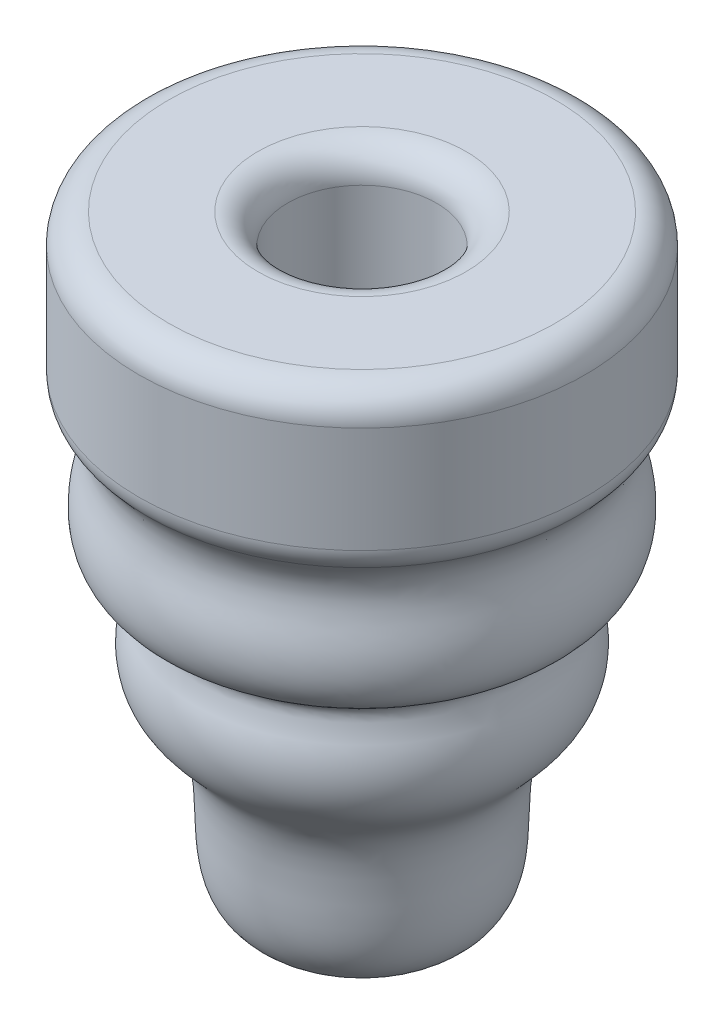
ISO-10303-21;
HEADER;
FILE_DESCRIPTION(('STEP AP214'),'2;1');
FILE_NAME('part.step','',(''),(''),'','','');
FILE_SCHEMA(('AUTOMOTIVE_DESIGN { 1 0 10303 214 1 1 1 1 }'));
ENDSEC;
DATA;
#1=APPLICATION_CONTEXT('core data for automotive mechanical design processes');
#2=APPLICATION_PROTOCOL_DEFINITION('international standard','automotive_design',2000,#1);
#3=PRODUCT_CONTEXT('',#1,'mechanical');
#4=PRODUCT('Part','Part','',(#3));
#5=PRODUCT_RELATED_PRODUCT_CATEGORY('part','',(#4));
#6=PRODUCT_DEFINITION_FORMATION('','',#4);
#7=PRODUCT_DEFINITION_CONTEXT('part definition',#1,'design');
#8=PRODUCT_DEFINITION('design','',#6,#7);
#9=PRODUCT_DEFINITION_SHAPE('','',#8);
#10=(LENGTH_UNIT() NAMED_UNIT(*) SI_UNIT(.MILLI.,.METRE.));
#11=(NAMED_UNIT(*) PLANE_ANGLE_UNIT() SI_UNIT($,.RADIAN.));
#12=(NAMED_UNIT(*) SI_UNIT($,.STERADIAN.) SOLID_ANGLE_UNIT());
#13=UNCERTAINTY_MEASURE_WITH_UNIT(LENGTH_MEASURE(1.E-05),#10,'distance_accuracy_value','');
#14=(GEOMETRIC_REPRESENTATION_CONTEXT(3) GLOBAL_UNCERTAINTY_ASSIGNED_CONTEXT((#13)) GLOBAL_UNIT_ASSIGNED_CONTEXT((#10,
#11,#12)) REPRESENTATION_CONTEXT('',''));
#15=CARTESIAN_POINT('',(0.,0.,0.));
#16=DIRECTION('',(0.,0.,1.));
#17=DIRECTION('',(1.,0.,0.));
#18=AXIS2_PLACEMENT_3D('',#15,#16,#17);
#19=CARTESIAN_POINT('',(0.,-21.0748435326025,0.));
#20=CARTESIAN_POINT('',(0.,-22.1214673288562,-14.3244061152591));
#21=CARTESIAN_POINT('',(0.,-9.88711355984805,-6.58166442757298));
#22=CARTESIAN_POINT('',(0.,-3.7154860908792,-14.719217472943));
#23=CARTESIAN_POINT('',(0.,0.707996920661093,-15.2558049195243));
#24=CARTESIAN_POINT('',(0.,4.78509220947727,-13.1158107856365));
#25=CARTESIAN_POINT('',(0.,6.20967271910428,-17.7067959682645));
#26=CARTESIAN_POINT('',(0.,10.1640704162297,-17.9431239567048));
#27=CARTESIAN_POINT('',(0.,13.963887666272,-16.8487012926829));
#28=CARTESIAN_POINT('',(0.,16.199163894463,-16.5543256365199));
#29=CARTESIAN_POINT('',(0.,18.0061250155635,-18.3244504780214));
#30=B_SPLINE_CURVE_WITH_KNOTS('',3,(#19,#20,#21,#22,#23,#24,#25,#26,#27,#28,#29),.UNSPECIFIED.,
.F.,.F.,(4,1,1,1,1,1,1,1,4),(0.013383664062469,0.409414025085695,0.504577101546611,
0.617222633450699,0.675636376214534,0.744772504264731,0.847800756052459,0.888628521041247,1.),.UNSPECIFIED.);
#31=CARTESIAN_POINT('',(0.,80.0041809851088,0.));
#32=DIRECTION('',(0.,1.,0.));
#33=AXIS1_PLACEMENT('',#31,#32);
#34=SURFACE_OF_REVOLUTION('',#30,#33);
#35=CARTESIAN_POINT('',(0.,18.0061250155635,0.));
#36=DIRECTION('',(0.,1.,0.));
#37=DIRECTION('',(0.,0.,1.));
#38=AXIS2_PLACEMENT_3D('',#35,#36,#37);
#39=CIRCLE('',#38,18.3244504780214);
#40=CARTESIAN_POINT('',(0.,18.0061250155635,18.3244504780214));
#41=VERTEX_POINT('',#40);
#42=EDGE_CURVE('E11',#41,#41,#39,.T.);
#43=ORIENTED_EDGE('',*,*,#42,.F.);
#44=EDGE_LOOP('',(#43));
#45=FACE_BOUND('',#44,.T.);
#46=CARTESIAN_POINT('',(0.,-21.0748435326025,0.));
#47=VERTEX_POINT('',#46);
#48=VERTEX_LOOP('',#47);
#49=FACE_BOUND('',#48,.T.);
#50=ADVANCED_FACE('F33',(#45,#49),#34,.T.);
#51=CARTESIAN_POINT('',(0.,19.7835865377372,0.));
#52=DIRECTION('',(0.,1.,0.));
#53=DIRECTION('',(0.,0.,1.));
#54=AXIS2_PLACEMENT_3D('',#51,#52,#53);
#55=TOROIDAL_SURFACE('',#54,16.51,2.54);
#56=CARTESIAN_POINT('',(0.,19.7835865377372,0.));
#57=DIRECTION('',(0.,1.,0.));
#58=DIRECTION('',(0.,0.,1.));
#59=AXIS2_PLACEMENT_3D('',#56,#57,#58);
#60=CIRCLE('',#59,19.05);
#61=CARTESIAN_POINT('',(0.,19.7835865377372,19.05));
#62=VERTEX_POINT('',#61);
#63=EDGE_CURVE('E40',#62,#62,#60,.T.);
#64=ORIENTED_EDGE('',*,*,#63,.F.);
#65=EDGE_LOOP('',(#64));
#66=FACE_BOUND('',#65,.T.);
#67=ORIENTED_EDGE('',*,*,#42,.T.);
#68=EDGE_LOOP('',(#67));
#69=FACE_BOUND('',#68,.T.);
#70=ADVANCED_FACE('F44',(#66,#69),#55,.T.);
#71=CARTESIAN_POINT('',(0.,80.0041809851088,0.));
#72=DIRECTION('',(0.,1.,0.));
#73=DIRECTION('',(0.,0.,1.));
#74=AXIS2_PLACEMENT_3D('',#71,#72,#73);
#75=CYLINDRICAL_SURFACE('',#74,19.05);
#76=CARTESIAN_POINT('',(0.,28.8317640320637,0.));
#77=DIRECTION('',(0.,1.,0.));
#78=DIRECTION('',(0.,0.,1.));
#79=AXIS2_PLACEMENT_3D('',#76,#77,#78);
#80=CIRCLE('',#79,19.05);
#81=CARTESIAN_POINT('',(0.,28.8317640320637,19.05));
#82=VERTEX_POINT('',#81);
#83=EDGE_CURVE('E98',#82,#82,#80,.T.);
#84=ORIENTED_EDGE('',*,*,#83,.F.);
#85=EDGE_LOOP('',(#84));
#86=FACE_BOUND('',#85,.T.);
#87=ORIENTED_EDGE('',*,*,#63,.T.);
#88=EDGE_LOOP('',(#87));
#89=FACE_BOUND('',#88,.T.);
#90=ADVANCED_FACE('F49',(#86,#89),#75,.T.);
#91=CARTESIAN_POINT('',(0.,28.8317640320637,0.));
#92=DIRECTION('',(0.,1.,0.));
#93=DIRECTION('',(0.,0.,1.));
#94=AXIS2_PLACEMENT_3D('',#91,#92,#93);
#95=TOROIDAL_SURFACE('',#94,16.51,2.54);
#96=CARTESIAN_POINT('',(0.,31.3717640320637,0.));
#97=DIRECTION('',(0.,1.,0.));
#98=DIRECTION('',(0.,0.,1.));
#99=AXIS2_PLACEMENT_3D('',#96,#97,#98);
#100=CIRCLE('',#99,16.51);
#101=CARTESIAN_POINT('',(0.,31.3717640320637,16.51));
#102=VERTEX_POINT('',#101);
#103=EDGE_CURVE('E95',#102,#102,#100,.T.);
#104=ORIENTED_EDGE('',*,*,#103,.F.);
#105=EDGE_LOOP('',(#104));
#106=FACE_BOUND('',#105,.T.);
#107=ORIENTED_EDGE('',*,*,#83,.T.);
#108=EDGE_LOOP('',(#107));
#109=FACE_BOUND('',#108,.T.);
#110=ADVANCED_FACE('F56',(#106,#109),#95,.T.);
#111=CARTESIAN_POINT('',(0.,31.3717640320637,-8.89000000000002));
#112=DIRECTION('',(0.,-1.,0.));
#113=DIRECTION('',(0.,0.,-1.));
#114=AXIS2_PLACEMENT_3D('',#111,#112,#113);
#115=PLANE('',#114);
#116=CARTESIAN_POINT('',(0.,31.3717640320637,0.));
#117=DIRECTION('',(0.,1.,0.));
#118=DIRECTION('',(0.,0.,1.));
#119=AXIS2_PLACEMENT_3D('',#116,#117,#118);
#120=CIRCLE('',#119,8.89000000000002);
#121=CARTESIAN_POINT('',(0.,31.3717640320637,8.89000000000002));
#122=VERTEX_POINT('',#121);
#123=EDGE_CURVE('E87',#122,#122,#120,.T.);
#124=ORIENTED_EDGE('',*,*,#123,.F.);
#125=EDGE_LOOP('',(#124));
#126=FACE_BOUND('',#125,.T.);
#127=ORIENTED_EDGE('',*,*,#103,.T.);
#128=EDGE_LOOP('',(#127));
#129=FACE_BOUND('',#128,.T.);
#130=ADVANCED_FACE('F63',(#126,#129),#115,.F.);
#131=CARTESIAN_POINT('',(0.,28.8317640320637,0.));
#132=DIRECTION('',(0.,1.,0.));
#133=DIRECTION('',(0.,0.,1.));
#134=AXIS2_PLACEMENT_3D('',#131,#132,#133);
#135=TOROIDAL_SURFACE('',#134,8.89,2.54);
#136=CARTESIAN_POINT('',(0.,28.8317640320637,0.));
#137=DIRECTION('',(0.,1.,0.));
#138=DIRECTION('',(0.,0.,1.));
#139=AXIS2_PLACEMENT_3D('',#136,#137,#138);
#140=CIRCLE('',#139,6.35);
#141=CARTESIAN_POINT('',(0.,28.8317640320637,6.35));
#142=VERTEX_POINT('',#141);
#143=EDGE_CURVE('E84',#142,#142,#140,.T.);
#144=ORIENTED_EDGE('',*,*,#143,.F.);
#145=EDGE_LOOP('',(#144));
#146=FACE_BOUND('',#145,.T.);
#147=ORIENTED_EDGE('',*,*,#123,.T.);
#148=EDGE_LOOP('',(#147));
#149=FACE_BOUND('',#148,.T.);
#150=ADVANCED_FACE('F67',(#146,#149),#135,.T.);
#151=CARTESIAN_POINT('',(0.,80.0041809851088,0.));
#152=DIRECTION('',(0.,1.,0.));
#153=DIRECTION('',(0.,0.,1.));
#154=AXIS2_PLACEMENT_3D('',#151,#152,#153);
#155=CYLINDRICAL_SURFACE('',#154,6.35);
#156=CARTESIAN_POINT('',(0.,18.6717640320637,0.));
#157=DIRECTION('',(0.,1.,0.));
#158=DIRECTION('',(0.,0.,1.));
#159=AXIS2_PLACEMENT_3D('',#156,#157,#158);
#160=CIRCLE('',#159,6.35);
#161=CARTESIAN_POINT('',(0.,18.6717640320637,6.35));
#162=VERTEX_POINT('',#161);
#163=EDGE_CURVE('E83',#162,#162,#160,.T.);
#164=ORIENTED_EDGE('',*,*,#163,.F.);
#165=EDGE_LOOP('',(#164));
#166=FACE_BOUND('',#165,.T.);
#167=ORIENTED_EDGE('',*,*,#143,.T.);
#168=EDGE_LOOP('',(#167));
#169=FACE_BOUND('',#168,.T.);
#170=ADVANCED_FACE('F71',(#166,#169),#155,.F.);
#171=CARTESIAN_POINT('',(0.,18.6717640320637,0.));
#172=DIRECTION('',(0.,-1.,0.));
#173=DIRECTION('',(0.,0.,-1.));
#174=AXIS2_PLACEMENT_3D('',#171,#172,#173);
#175=PLANE('',#174);
#176=ORIENTED_EDGE('',*,*,#163,.T.);
#177=EDGE_LOOP('',(#176));
#178=FACE_BOUND('',#177,.T.);
#179=ADVANCED_FACE('F75',(#178),#175,.F.);
#180=CLOSED_SHELL('',(#50,#70,#90,#110,#130,#150,#170,#179));
#181=MANIFOLD_SOLID_BREP('B2',#180);
#182=ADVANCED_BREP_SHAPE_REPRESENTATION('',(#18,#181),#14);
#183=SHAPE_DEFINITION_REPRESENTATION(#9,#182);
ENDSEC;
END-ISO-10303-21;
